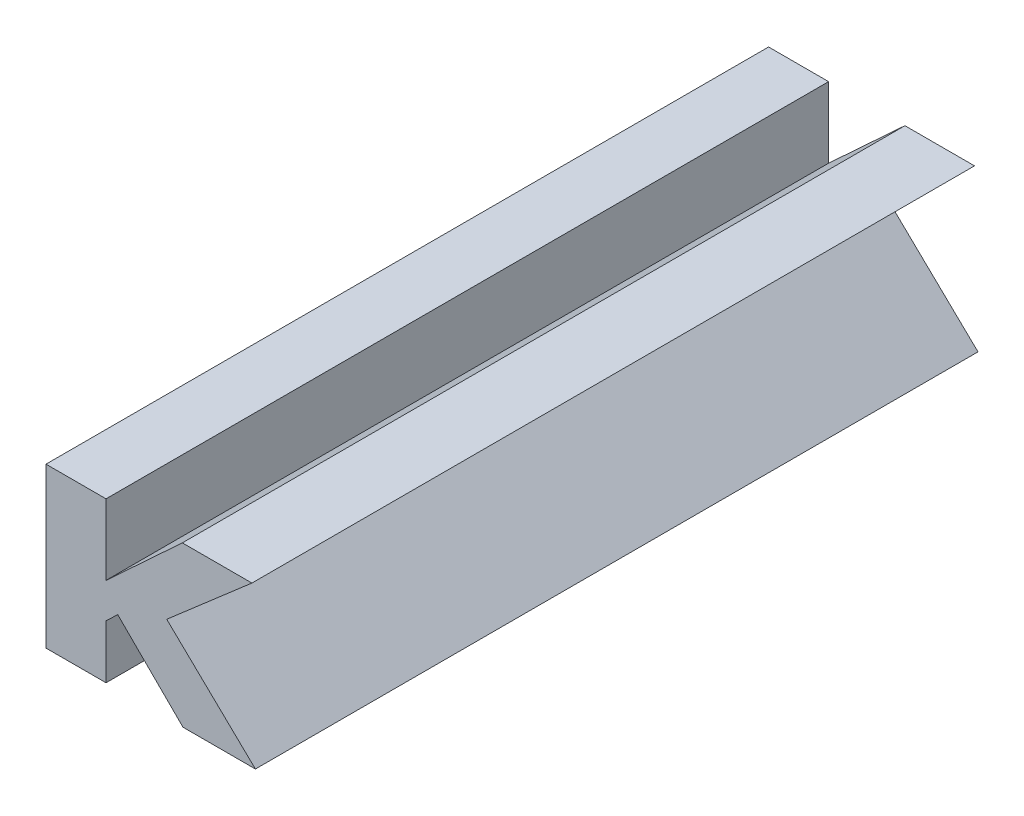
ISO-10303-21;
HEADER;
FILE_DESCRIPTION(('STEP AP214'),'2;1');
FILE_NAME('part.step','',(''),(''),'','','');
FILE_SCHEMA(('AUTOMOTIVE_DESIGN { 1 0 10303 214 1 1 1 1 }'));
ENDSEC;
DATA;
#1=APPLICATION_CONTEXT('core data for automotive mechanical design processes');
#2=APPLICATION_PROTOCOL_DEFINITION('international standard','automotive_design',2000,#1);
#3=PRODUCT_CONTEXT('',#1,'mechanical');
#4=PRODUCT('Part','Part','',(#3));
#5=PRODUCT_RELATED_PRODUCT_CATEGORY('part','',(#4));
#6=PRODUCT_DEFINITION_FORMATION('','',#4);
#7=PRODUCT_DEFINITION_CONTEXT('part definition',#1,'design');
#8=PRODUCT_DEFINITION('design','',#6,#7);
#9=PRODUCT_DEFINITION_SHAPE('','',#8);
#10=(LENGTH_UNIT() NAMED_UNIT(*) SI_UNIT(.MILLI.,.METRE.));
#11=(NAMED_UNIT(*) PLANE_ANGLE_UNIT() SI_UNIT($,.RADIAN.));
#12=(NAMED_UNIT(*) SI_UNIT($,.STERADIAN.) SOLID_ANGLE_UNIT());
#13=UNCERTAINTY_MEASURE_WITH_UNIT(LENGTH_MEASURE(1.E-05),#10,'distance_accuracy_value','');
#14=(GEOMETRIC_REPRESENTATION_CONTEXT(3) GLOBAL_UNCERTAINTY_ASSIGNED_CONTEXT((#13)) GLOBAL_UNIT_ASSIGNED_CONTEXT((#10,
#11,#12)) REPRESENTATION_CONTEXT('',''));
#15=CARTESIAN_POINT('',(0.,0.,0.));
#16=DIRECTION('',(0.,0.,1.));
#17=DIRECTION('',(1.,0.,0.));
#18=AXIS2_PLACEMENT_3D('',#15,#16,#17);
#19=CARTESIAN_POINT('',(-1.1974027512623,-0.394100289079776,0.));
#20=DIRECTION('',(-0.704997078336114,-0.709210208286332,0.));
#21=DIRECTION('',(0.709210208286332,-0.704997078336114,0.));
#22=AXIS2_PLACEMENT_3D('',#19,#20,#21);
#23=PLANE('',#22);
#24=DIRECTION('',(-0.709210208286332,0.704997078336114,0.));
#25=VECTOR('',#24,1.);
#26=CARTESIAN_POINT('',(-1.1883790477517,-0.403070386430895,0.));
#27=LINE('',#26,#25);
#28=CARTESIAN_POINT('',(-1.1883790477517,-0.403070386430895,0.));
#29=VERTEX_POINT('',#28);
#30=CARTESIAN_POINT('',(-1.1974027512623,-0.394100289079776,0.));
#31=VERTEX_POINT('',#30);
#32=EDGE_CURVE('E11',#29,#31,#27,.T.);
#33=ORIENTED_EDGE('',*,*,#32,.F.);
#34=DIRECTION('',(0.,0.,1.));
#35=VECTOR('',#34,1.);
#36=CARTESIAN_POINT('',(-1.1883790477517,-0.403070386430895,0.));
#37=LINE('',#36,#35);
#38=CARTESIAN_POINT('',(-1.1883790477517,-0.403070386430895,0.1));
#39=VERTEX_POINT('',#38);
#40=EDGE_CURVE('E24',#29,#39,#37,.T.);
#41=ORIENTED_EDGE('',*,*,#40,.T.);
#42=DIRECTION('',(0.709210208286332,-0.704997078336114,0.));
#43=VECTOR('',#42,1.);
#44=CARTESIAN_POINT('',(-1.1883790477517,-0.403070386430895,0.1));
#45=LINE('',#44,#43);
#46=CARTESIAN_POINT('',(-1.1974027512623,-0.394100289079776,0.1));
#47=VERTEX_POINT('',#46);
#48=EDGE_CURVE('E124',#47,#39,#45,.T.);
#49=ORIENTED_EDGE('',*,*,#48,.F.);
#50=DIRECTION('',(0.,0.,1.));
#51=VECTOR('',#50,1.);
#52=CARTESIAN_POINT('',(-1.1974027512623,-0.394100289079776,0.));
#53=LINE('',#52,#51);
#54=EDGE_CURVE('E197',#31,#47,#53,.T.);
#55=ORIENTED_EDGE('',*,*,#54,.F.);
#56=EDGE_LOOP('',(#33,#41,#49,#55));
#57=FACE_BOUND('',#56,.T.);
#58=ADVANCED_FACE('F17',(#57),#23,.T.);
#59=CARTESIAN_POINT('',(-1.1990288047662,-0.395619130264726,0.));
#60=DIRECTION('',(0.682604325383963,-0.730788160116942,0.));
#61=DIRECTION('',(0.730788160116942,0.682604325383963,0.));
#62=AXIS2_PLACEMENT_3D('',#59,#60,#61);
#63=PLANE('',#62);
#64=DIRECTION('',(-0.730788160116942,-0.682604325383963,0.));
#65=VECTOR('',#64,1.);
#66=CARTESIAN_POINT('',(-1.1974027512623,-0.394100289079776,0.));
#67=LINE('',#66,#65);
#68=CARTESIAN_POINT('',(-1.1990288047662,-0.395619130264726,0.));
#69=VERTEX_POINT('',#68);
#70=EDGE_CURVE('E195',#31,#69,#67,.T.);
#71=ORIENTED_EDGE('',*,*,#70,.F.);
#72=ORIENTED_EDGE('',*,*,#54,.T.);
#73=DIRECTION('',(0.730788160116942,0.682604325383963,0.));
#74=VECTOR('',#73,1.);
#75=CARTESIAN_POINT('',(-1.1974027512623,-0.394100289079776,0.1));
#76=LINE('',#75,#74);
#77=CARTESIAN_POINT('',(-1.1990288047662,-0.395619130264726,0.1));
#78=VERTEX_POINT('',#77);
#79=EDGE_CURVE('E193',#78,#47,#76,.T.);
#80=ORIENTED_EDGE('',*,*,#79,.F.);
#81=DIRECTION('',(0.,0.,1.));
#82=VECTOR('',#81,1.);
#83=CARTESIAN_POINT('',(-1.1990288047662,-0.395619130264726,0.));
#84=LINE('',#83,#82);
#85=EDGE_CURVE('E190',#69,#78,#84,.T.);
#86=ORIENTED_EDGE('',*,*,#85,.F.);
#87=EDGE_LOOP('',(#71,#72,#80,#86));
#88=FACE_BOUND('',#87,.T.);
#89=ADVANCED_FACE('F235',(#88),#63,.T.);
#90=CARTESIAN_POINT('',(-1.1990288047662,-0.403070386430895,0.));
#91=DIRECTION('',(1.,0.,0.));
#92=DIRECTION('',(0.,1.,0.));
#93=AXIS2_PLACEMENT_3D('',#90,#91,#92);
#94=PLANE('',#93);
#95=DIRECTION('',(0.,-1.,0.));
#96=VECTOR('',#95,1.);
#97=CARTESIAN_POINT('',(-1.1990288047662,-0.395619130264726,0.));
#98=LINE('',#97,#96);
#99=CARTESIAN_POINT('',(-1.1990288047662,-0.403070386430895,0.));
#100=VERTEX_POINT('',#99);
#101=EDGE_CURVE('E188',#69,#100,#98,.T.);
#102=ORIENTED_EDGE('',*,*,#101,.F.);
#103=ORIENTED_EDGE('',*,*,#85,.T.);
#104=DIRECTION('',(0.,1.,0.));
#105=VECTOR('',#104,1.);
#106=CARTESIAN_POINT('',(-1.1990288047662,-0.395619130264726,0.1));
#107=LINE('',#106,#105);
#108=CARTESIAN_POINT('',(-1.1990288047662,-0.403070386430895,0.1));
#109=VERTEX_POINT('',#108);
#110=EDGE_CURVE('E185',#109,#78,#107,.T.);
#111=ORIENTED_EDGE('',*,*,#110,.F.);
#112=DIRECTION('',(0.,0.,1.));
#113=VECTOR('',#112,1.);
#114=CARTESIAN_POINT('',(-1.1990288047662,-0.403070386430895,0.));
#115=LINE('',#114,#113);
#116=EDGE_CURVE('E182',#100,#109,#115,.T.);
#117=ORIENTED_EDGE('',*,*,#116,.F.);
#118=EDGE_LOOP('',(#102,#103,#111,#117));
#119=FACE_BOUND('',#118,.T.);
#120=ADVANCED_FACE('F231',(#119),#94,.T.);
#121=CARTESIAN_POINT('',(-1.2073377594839,-0.403070386430895,0.));
#122=DIRECTION('',(0.,-1.,0.));
#123=DIRECTION('',(1.,0.,0.));
#124=AXIS2_PLACEMENT_3D('',#121,#122,#123);
#125=PLANE('',#124);
#126=DIRECTION('',(-1.,0.,0.));
#127=VECTOR('',#126,1.);
#128=CARTESIAN_POINT('',(-1.1990288047662,-0.403070386430895,0.));
#129=LINE('',#128,#127);
#130=CARTESIAN_POINT('',(-1.2073377594839,-0.403070386430895,0.));
#131=VERTEX_POINT('',#130);
#132=EDGE_CURVE('E180',#100,#131,#129,.T.);
#133=ORIENTED_EDGE('',*,*,#132,.F.);
#134=ORIENTED_EDGE('',*,*,#116,.T.);
#135=DIRECTION('',(1.,0.,0.));
#136=VECTOR('',#135,1.);
#137=CARTESIAN_POINT('',(-1.1990288047662,-0.403070386430895,0.1));
#138=LINE('',#137,#136);
#139=CARTESIAN_POINT('',(-1.2073377594839,-0.403070386430895,0.1));
#140=VERTEX_POINT('',#139);
#141=EDGE_CURVE('E177',#140,#109,#138,.T.);
#142=ORIENTED_EDGE('',*,*,#141,.F.);
#143=DIRECTION('',(0.,0.,1.));
#144=VECTOR('',#143,1.);
#145=CARTESIAN_POINT('',(-1.2073377594839,-0.403070386430895,0.));
#146=LINE('',#145,#144);
#147=EDGE_CURVE('E174',#131,#140,#146,.T.);
#148=ORIENTED_EDGE('',*,*,#147,.F.);
#149=EDGE_LOOP('',(#133,#134,#142,#148));
#150=FACE_BOUND('',#149,.T.);
#151=ADVANCED_FACE('F227',(#150),#125,.T.);
#152=CARTESIAN_POINT('',(-1.2073377594839,-0.381020386169379,0.));
#153=DIRECTION('',(-1.,0.,0.));
#154=DIRECTION('',(0.,-1.,0.));
#155=AXIS2_PLACEMENT_3D('',#152,#153,#154);
#156=PLANE('',#155);
#157=DIRECTION('',(0.,1.,0.));
#158=VECTOR('',#157,1.);
#159=CARTESIAN_POINT('',(-1.2073377594839,-0.403070386430895,0.));
#160=LINE('',#159,#158);
#161=CARTESIAN_POINT('',(-1.2073377594839,-0.381020386169379,0.));
#162=VERTEX_POINT('',#161);
#163=EDGE_CURVE('E172',#131,#162,#160,.T.);
#164=ORIENTED_EDGE('',*,*,#163,.F.);
#165=ORIENTED_EDGE('',*,*,#147,.T.);
#166=DIRECTION('',(0.,-1.,0.));
#167=VECTOR('',#166,1.);
#168=CARTESIAN_POINT('',(-1.2073377594839,-0.403070386430895,0.1));
#169=LINE('',#168,#167);
#170=CARTESIAN_POINT('',(-1.2073377594839,-0.381020386169379,0.1));
#171=VERTEX_POINT('',#170);
#172=EDGE_CURVE('E169',#171,#140,#169,.T.);
#173=ORIENTED_EDGE('',*,*,#172,.F.);
#174=DIRECTION('',(0.,0.,1.));
#175=VECTOR('',#174,1.);
#176=CARTESIAN_POINT('',(-1.2073377594839,-0.381020386169379,0.));
#177=LINE('',#176,#175);
#178=EDGE_CURVE('E166',#162,#171,#177,.T.);
#179=ORIENTED_EDGE('',*,*,#178,.F.);
#180=EDGE_LOOP('',(#164,#165,#173,#179));
#181=FACE_BOUND('',#180,.T.);
#182=ADVANCED_FACE('F223',(#181),#156,.T.);
#183=CARTESIAN_POINT('',(-1.1990288047662,-0.381020386169379,0.));
#184=DIRECTION('',(0.,1.,0.));
#185=DIRECTION('',(-1.,0.,0.));
#186=AXIS2_PLACEMENT_3D('',#183,#184,#185);
#187=PLANE('',#186);
#188=DIRECTION('',(1.,0.,0.));
#189=VECTOR('',#188,1.);
#190=CARTESIAN_POINT('',(-1.2073377594839,-0.381020386169379,0.));
#191=LINE('',#190,#189);
#192=CARTESIAN_POINT('',(-1.1990288047662,-0.381020386169379,0.));
#193=VERTEX_POINT('',#192);
#194=EDGE_CURVE('E164',#162,#193,#191,.T.);
#195=ORIENTED_EDGE('',*,*,#194,.F.);
#196=ORIENTED_EDGE('',*,*,#178,.T.);
#197=DIRECTION('',(-1.,0.,0.));
#198=VECTOR('',#197,1.);
#199=CARTESIAN_POINT('',(-1.2073377594839,-0.381020386169379,0.1));
#200=LINE('',#199,#198);
#201=CARTESIAN_POINT('',(-1.1990288047662,-0.381020386169379,0.1));
#202=VERTEX_POINT('',#201);
#203=EDGE_CURVE('E161',#202,#171,#200,.T.);
#204=ORIENTED_EDGE('',*,*,#203,.F.);
#205=DIRECTION('',(0.,0.,1.));
#206=VECTOR('',#205,1.);
#207=CARTESIAN_POINT('',(-1.1990288047662,-0.381020386169379,0.));
#208=LINE('',#207,#206);
#209=EDGE_CURVE('E158',#193,#202,#208,.T.);
#210=ORIENTED_EDGE('',*,*,#209,.F.);
#211=EDGE_LOOP('',(#195,#196,#204,#210));
#212=FACE_BOUND('',#211,.T.);
#213=ADVANCED_FACE('F219',(#212),#187,.T.);
#214=CARTESIAN_POINT('',(-1.1990288047662,-0.390794575912531,0.));
#215=DIRECTION('',(1.,0.,0.));
#216=DIRECTION('',(0.,1.,0.));
#217=AXIS2_PLACEMENT_3D('',#214,#215,#216);
#218=PLANE('',#217);
#219=DIRECTION('',(0.,-1.,0.));
#220=VECTOR('',#219,1.);
#221=CARTESIAN_POINT('',(-1.1990288047662,-0.381020386169379,0.));
#222=LINE('',#221,#220);
#223=CARTESIAN_POINT('',(-1.1990288047662,-0.390794575912531,0.));
#224=VERTEX_POINT('',#223);
#225=EDGE_CURVE('E156',#193,#224,#222,.T.);
#226=ORIENTED_EDGE('',*,*,#225,.F.);
#227=ORIENTED_EDGE('',*,*,#209,.T.);
#228=DIRECTION('',(0.,1.,0.));
#229=VECTOR('',#228,1.);
#230=CARTESIAN_POINT('',(-1.1990288047662,-0.381020386169379,0.1));
#231=LINE('',#230,#229);
#232=CARTESIAN_POINT('',(-1.1990288047662,-0.390794575912531,0.1));
#233=VERTEX_POINT('',#232);
#234=EDGE_CURVE('E153',#233,#202,#231,.T.);
#235=ORIENTED_EDGE('',*,*,#234,.F.);
#236=DIRECTION('',(0.,0.,1.));
#237=VECTOR('',#236,1.);
#238=CARTESIAN_POINT('',(-1.1990288047662,-0.390794575912531,0.));
#239=LINE('',#238,#237);
#240=EDGE_CURVE('E150',#224,#233,#239,.T.);
#241=ORIENTED_EDGE('',*,*,#240,.F.);
#242=EDGE_LOOP('',(#226,#227,#235,#241));
#243=FACE_BOUND('',#242,.T.);
#244=ADVANCED_FACE('F215',(#243),#218,.T.);
#245=CARTESIAN_POINT('',(-1.1884683913508,-0.381020386169379,0.));
#246=DIRECTION('',(-0.679259442923075,0.733898228094218,0.));
#247=DIRECTION('',(-0.733898228094218,-0.679259442923075,0.));
#248=AXIS2_PLACEMENT_3D('',#245,#246,#247);
#249=PLANE('',#248);
#250=DIRECTION('',(0.733898228094218,0.679259442923075,0.));
#251=VECTOR('',#250,1.);
#252=CARTESIAN_POINT('',(-1.1990288047662,-0.390794575912531,0.));
#253=LINE('',#252,#251);
#254=CARTESIAN_POINT('',(-1.1884683913508,-0.381020386169379,0.));
#255=VERTEX_POINT('',#254);
#256=EDGE_CURVE('E148',#224,#255,#253,.T.);
#257=ORIENTED_EDGE('',*,*,#256,.F.);
#258=ORIENTED_EDGE('',*,*,#240,.T.);
#259=DIRECTION('',(-0.733898228094218,-0.679259442923075,0.));
#260=VECTOR('',#259,1.);
#261=CARTESIAN_POINT('',(-1.1990288047662,-0.390794575912531,0.1));
#262=LINE('',#261,#260);
#263=CARTESIAN_POINT('',(-1.1884683913508,-0.381020386169379,0.1));
#264=VERTEX_POINT('',#263);
#265=EDGE_CURVE('E145',#264,#233,#262,.T.);
#266=ORIENTED_EDGE('',*,*,#265,.F.);
#267=DIRECTION('',(0.,0.,1.));
#268=VECTOR('',#267,1.);
#269=CARTESIAN_POINT('',(-1.1884683913508,-0.381020386169379,0.));
#270=LINE('',#269,#268);
#271=EDGE_CURVE('E142',#255,#264,#270,.T.);
#272=ORIENTED_EDGE('',*,*,#271,.F.);
#273=EDGE_LOOP('',(#257,#258,#266,#272));
#274=FACE_BOUND('',#273,.T.);
#275=ADVANCED_FACE('F211',(#274),#249,.T.);
#276=CARTESIAN_POINT('',(-1.1788371513663,-0.381020386169379,0.));
#277=DIRECTION('',(0.,1.,0.));
#278=DIRECTION('',(-1.,0.,0.));
#279=AXIS2_PLACEMENT_3D('',#276,#277,#278);
#280=PLANE('',#279);
#281=DIRECTION('',(1.,0.,0.));
#282=VECTOR('',#281,1.);
#283=CARTESIAN_POINT('',(-1.1884683913508,-0.381020386169379,0.));
#284=LINE('',#283,#282);
#285=CARTESIAN_POINT('',(-1.1788371513663,-0.381020386169379,0.));
#286=VERTEX_POINT('',#285);
#287=EDGE_CURVE('E140',#255,#286,#284,.T.);
#288=ORIENTED_EDGE('',*,*,#287,.F.);
#289=ORIENTED_EDGE('',*,*,#271,.T.);
#290=DIRECTION('',(-1.,0.,0.));
#291=VECTOR('',#290,1.);
#292=CARTESIAN_POINT('',(-1.1884683913508,-0.381020386169379,0.1));
#293=LINE('',#292,#291);
#294=CARTESIAN_POINT('',(-1.1788371513663,-0.381020386169379,0.1));
#295=VERTEX_POINT('',#294);
#296=EDGE_CURVE('E137',#295,#264,#293,.T.);
#297=ORIENTED_EDGE('',*,*,#296,.F.);
#298=DIRECTION('',(0.,0.,1.));
#299=VECTOR('',#298,1.);
#300=CARTESIAN_POINT('',(-1.1788371513663,-0.381020386169379,0.));
#301=LINE('',#300,#299);
#302=EDGE_CURVE('E134',#286,#295,#301,.T.);
#303=ORIENTED_EDGE('',*,*,#302,.F.);
#304=EDGE_LOOP('',(#288,#289,#297,#303));
#305=FACE_BOUND('',#304,.T.);
#306=ADVANCED_FACE('F207',(#305),#280,.T.);
#307=CARTESIAN_POINT('',(-1.1906305064494,-0.391259162627927,0.));
#308=DIRECTION('',(0.655583664540091,-0.75512254554356,0.));
#309=DIRECTION('',(0.75512254554356,0.655583664540091,0.));
#310=AXIS2_PLACEMENT_3D('',#307,#308,#309);
#311=PLANE('',#310);
#312=DIRECTION('',(-0.75512254554356,-0.655583664540091,0.));
#313=VECTOR('',#312,1.);
#314=CARTESIAN_POINT('',(-1.1788371513663,-0.381020386169379,0.));
#315=LINE('',#314,#313);
#316=CARTESIAN_POINT('',(-1.1906305064494,-0.391259162627927,0.));
#317=VERTEX_POINT('',#316);
#318=EDGE_CURVE('E132',#286,#317,#315,.T.);
#319=ORIENTED_EDGE('',*,*,#318,.F.);
#320=ORIENTED_EDGE('',*,*,#302,.T.);
#321=DIRECTION('',(0.75512254554356,0.655583664540091,0.));
#322=VECTOR('',#321,1.);
#323=CARTESIAN_POINT('',(-1.1788371513663,-0.381020386169379,0.1));
#324=LINE('',#323,#322);
#325=CARTESIAN_POINT('',(-1.1906305064494,-0.391259162627927,0.1));
#326=VERTEX_POINT('',#325);
#327=EDGE_CURVE('E130',#326,#295,#324,.T.);
#328=ORIENTED_EDGE('',*,*,#327,.F.);
#329=DIRECTION('',(0.,0.,1.));
#330=VECTOR('',#329,1.);
#331=CARTESIAN_POINT('',(-1.1906305064494,-0.391259162627927,0.));
#332=LINE('',#331,#330);
#333=EDGE_CURVE('E109',#317,#326,#332,.T.);
#334=ORIENTED_EDGE('',*,*,#333,.F.);
#335=EDGE_LOOP('',(#319,#320,#328,#334));
#336=FACE_BOUND('',#335,.T.);
#337=ADVANCED_FACE('F205',(#336),#311,.T.);
#338=CARTESIAN_POINT('',(-1.1783546959311,-0.403070386430895,0.));
#339=DIRECTION('',(0.693339266862846,0.720611310642632,0.));
#340=DIRECTION('',(-0.720611310642632,0.693339266862846,0.));
#341=AXIS2_PLACEMENT_3D('',#338,#339,#340);
#342=PLANE('',#341);
#343=DIRECTION('',(0.720611310642632,-0.693339266862846,0.));
#344=VECTOR('',#343,1.);
#345=CARTESIAN_POINT('',(-1.1906305064494,-0.391259162627927,0.));
#346=LINE('',#345,#344);
#347=CARTESIAN_POINT('',(-1.1783546959311,-0.403070386430895,0.));
#348=VERTEX_POINT('',#347);
#349=EDGE_CURVE('E113',#317,#348,#346,.T.);
#350=ORIENTED_EDGE('',*,*,#349,.F.);
#351=ORIENTED_EDGE('',*,*,#333,.T.);
#352=DIRECTION('',(-0.720611310642632,0.693339266862846,0.));
#353=VECTOR('',#352,1.);
#354=CARTESIAN_POINT('',(-1.1906305064494,-0.391259162627927,0.1));
#355=LINE('',#354,#353);
#356=CARTESIAN_POINT('',(-1.1783546959311,-0.403070386430895,0.1));
#357=VERTEX_POINT('',#356);
#358=EDGE_CURVE('E102',#357,#326,#355,.T.);
#359=ORIENTED_EDGE('',*,*,#358,.F.);
#360=DIRECTION('',(0.,0.,1.));
#361=VECTOR('',#360,1.);
#362=CARTESIAN_POINT('',(-1.1783546959311,-0.403070386430895,0.));
#363=LINE('',#362,#361);
#364=EDGE_CURVE('E106',#348,#357,#363,.T.);
#365=ORIENTED_EDGE('',*,*,#364,.F.);
#366=EDGE_LOOP('',(#350,#351,#359,#365));
#367=FACE_BOUND('',#366,.T.);
#368=ADVANCED_FACE('F105',(#367),#342,.T.);
#369=CARTESIAN_POINT('',(-1.1883790477517,-0.403070386430895,0.));
#370=DIRECTION('',(0.,-1.,0.));
#371=DIRECTION('',(1.,0.,0.));
#372=AXIS2_PLACEMENT_3D('',#369,#370,#371);
#373=PLANE('',#372);
#374=DIRECTION('',(-1.,0.,0.));
#375=VECTOR('',#374,1.);
#376=CARTESIAN_POINT('',(-1.1783546959311,-0.403070386430895,0.));
#377=LINE('',#376,#375);
#378=EDGE_CURVE('E119',#348,#29,#377,.T.);
#379=ORIENTED_EDGE('',*,*,#378,.F.);
#380=ORIENTED_EDGE('',*,*,#364,.T.);
#381=DIRECTION('',(1.,0.,0.));
#382=VECTOR('',#381,1.);
#383=CARTESIAN_POINT('',(-1.1783546959311,-0.403070386430895,0.1));
#384=LINE('',#383,#382);
#385=EDGE_CURVE('E118',#39,#357,#384,.T.);
#386=ORIENTED_EDGE('',*,*,#385,.F.);
#387=ORIENTED_EDGE('',*,*,#40,.F.);
#388=EDGE_LOOP('',(#379,#380,#386,#387));
#389=FACE_BOUND('',#388,.T.);
#390=ADVANCED_FACE('F117',(#389),#373,.T.);
#391=CARTESIAN_POINT('',(-1.1940876386242,-0.392008018939743,0.));
#392=DIRECTION('',(0.,0.,1.));
#393=DIRECTION('',(1.,0.,0.));
#394=AXIS2_PLACEMENT_3D('',#391,#392,#393);
#395=PLANE('',#394);
#396=ORIENTED_EDGE('',*,*,#378,.T.);
#397=ORIENTED_EDGE('',*,*,#32,.T.);
#398=ORIENTED_EDGE('',*,*,#70,.T.);
#399=ORIENTED_EDGE('',*,*,#101,.T.);
#400=ORIENTED_EDGE('',*,*,#132,.T.);
#401=ORIENTED_EDGE('',*,*,#163,.T.);
#402=ORIENTED_EDGE('',*,*,#194,.T.);
#403=ORIENTED_EDGE('',*,*,#225,.T.);
#404=ORIENTED_EDGE('',*,*,#256,.T.);
#405=ORIENTED_EDGE('',*,*,#287,.T.);
#406=ORIENTED_EDGE('',*,*,#318,.T.);
#407=ORIENTED_EDGE('',*,*,#349,.T.);
#408=EDGE_LOOP('',(#396,#397,#398,#399,#400,#401,#402,#403,#404,#405,#406,#407));
#409=FACE_BOUND('',#408,.T.);
#410=ADVANCED_FACE('F200',(#409),#395,.F.);
#411=CARTESIAN_POINT('',(-1.1940876386242,-0.392008018939743,0.1));
#412=DIRECTION('',(0.,0.,1.));
#413=DIRECTION('',(1.,0.,0.));
#414=AXIS2_PLACEMENT_3D('',#411,#412,#413);
#415=PLANE('',#414);
#416=ORIENTED_EDGE('',*,*,#385,.T.);
#417=ORIENTED_EDGE('',*,*,#358,.T.);
#418=ORIENTED_EDGE('',*,*,#327,.T.);
#419=ORIENTED_EDGE('',*,*,#296,.T.);
#420=ORIENTED_EDGE('',*,*,#265,.T.);
#421=ORIENTED_EDGE('',*,*,#234,.T.);
#422=ORIENTED_EDGE('',*,*,#203,.T.);
#423=ORIENTED_EDGE('',*,*,#172,.T.);
#424=ORIENTED_EDGE('',*,*,#141,.T.);
#425=ORIENTED_EDGE('',*,*,#110,.T.);
#426=ORIENTED_EDGE('',*,*,#79,.T.);
#427=ORIENTED_EDGE('',*,*,#48,.T.);
#428=EDGE_LOOP('',(#416,#417,#418,#419,#420,#421,#422,#423,#424,#425,#426,#427));
#429=FACE_BOUND('',#428,.T.);
#430=ADVANCED_FACE('F122',(#429),#415,.T.);
#431=CLOSED_SHELL('',(#58,#89,#120,#151,#182,#213,#244,#275,#306,#337,#368,#390,#410,#430));
#432=MANIFOLD_SOLID_BREP('B1',#431);
#433=ADVANCED_BREP_SHAPE_REPRESENTATION('',(#18,#432),#14);
#434=SHAPE_DEFINITION_REPRESENTATION(#9,#433);
ENDSEC;
END-ISO-10303-21;
